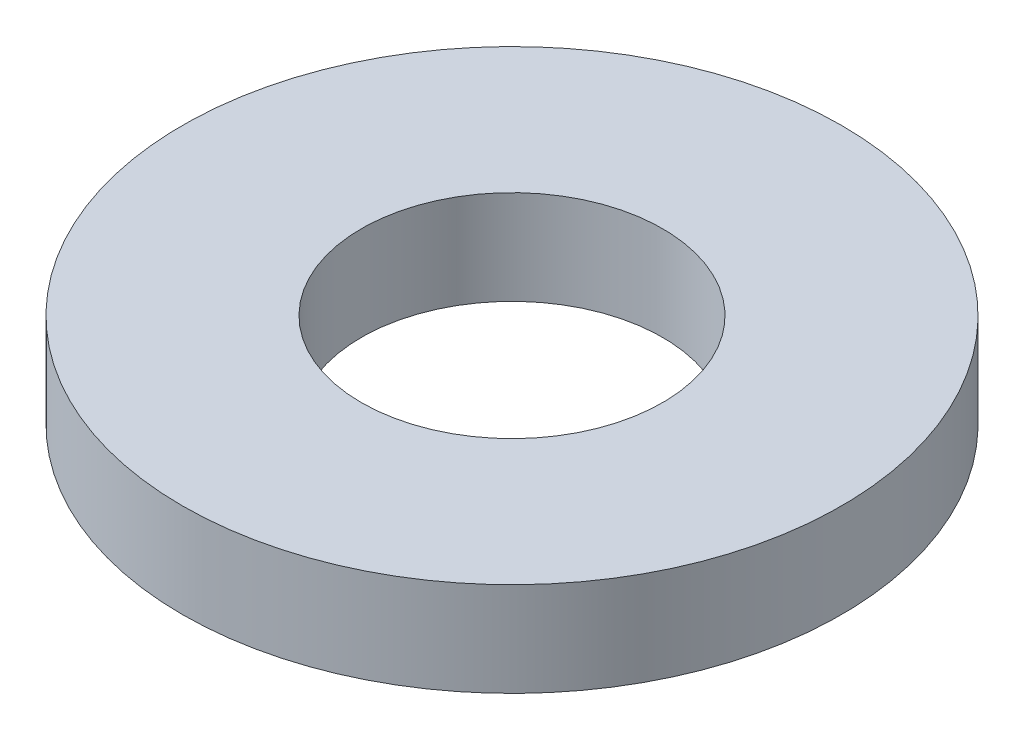
ISO-10303-21;
HEADER;
FILE_DESCRIPTION(('STEP AP214'),'2;1');
FILE_NAME('part.step','',(''),(''),'','','');
FILE_SCHEMA(('AUTOMOTIVE_DESIGN { 1 0 10303 214 1 1 1 1 }'));
ENDSEC;
DATA;
#1=APPLICATION_CONTEXT('core data for automotive mechanical design processes');
#2=APPLICATION_PROTOCOL_DEFINITION('international standard','automotive_design',2000,#1);
#3=PRODUCT_CONTEXT('',#1,'mechanical');
#4=PRODUCT('Part','Part','',(#3));
#5=PRODUCT_RELATED_PRODUCT_CATEGORY('part','',(#4));
#6=PRODUCT_DEFINITION_FORMATION('','',#4);
#7=PRODUCT_DEFINITION_CONTEXT('part definition',#1,'design');
#8=PRODUCT_DEFINITION('design','',#6,#7);
#9=PRODUCT_DEFINITION_SHAPE('','',#8);
#10=(LENGTH_UNIT() NAMED_UNIT(*) SI_UNIT(.MILLI.,.METRE.));
#11=(NAMED_UNIT(*) PLANE_ANGLE_UNIT() SI_UNIT($,.RADIAN.));
#12=(NAMED_UNIT(*) SI_UNIT($,.STERADIAN.) SOLID_ANGLE_UNIT());
#13=UNCERTAINTY_MEASURE_WITH_UNIT(LENGTH_MEASURE(1.E-05),#10,'distance_accuracy_value','');
#14=(GEOMETRIC_REPRESENTATION_CONTEXT(3) GLOBAL_UNCERTAINTY_ASSIGNED_CONTEXT((#13)) GLOBAL_UNIT_ASSIGNED_CONTEXT((#10,
#11,#12)) REPRESENTATION_CONTEXT('',''));
#15=CARTESIAN_POINT('',(0.,0.,0.));
#16=DIRECTION('',(0.,0.,1.));
#17=DIRECTION('',(1.,0.,0.));
#18=AXIS2_PLACEMENT_3D('',#15,#16,#17);
#19=CARTESIAN_POINT('',(0.,1.,0.));
#20=DIRECTION('',(0.,1.,0.));
#21=DIRECTION('',(0.,0.,1.));
#22=AXIS2_PLACEMENT_3D('',#19,#20,#21);
#23=PLANE('',#22);
#24=CARTESIAN_POINT('',(0.,1.,0.));
#25=DIRECTION('',(0.,1.,0.));
#26=DIRECTION('',(0.,0.,1.));
#27=AXIS2_PLACEMENT_3D('',#24,#25,#26);
#28=CIRCLE('',#27,3.5);
#29=CARTESIAN_POINT('',(0.,1.,3.5));
#30=VERTEX_POINT('',#29);
#31=EDGE_CURVE('E10',#30,#30,#28,.T.);
#32=ORIENTED_EDGE('',*,*,#31,.T.);
#33=EDGE_LOOP('',(#32));
#34=FACE_BOUND('',#33,.T.);
#35=CARTESIAN_POINT('',(0.,1.,0.));
#36=DIRECTION('',(0.,1.,0.));
#37=DIRECTION('',(0.,0.,1.));
#38=AXIS2_PLACEMENT_3D('',#35,#36,#37);
#39=CIRCLE('',#38,1.59999999999999);
#40=CARTESIAN_POINT('',(0.,1.,1.59999999999999));
#41=VERTEX_POINT('',#40);
#42=EDGE_CURVE('E43',#41,#41,#39,.T.);
#43=ORIENTED_EDGE('',*,*,#42,.F.);
#44=EDGE_LOOP('',(#43));
#45=FACE_BOUND('',#44,.T.);
#46=ADVANCED_FACE('F32',(#34,#45),#23,.T.);
#47=CARTESIAN_POINT('',(0.,0.,0.));
#48=DIRECTION('',(0.,1.,0.));
#49=DIRECTION('',(0.,0.,1.));
#50=AXIS2_PLACEMENT_3D('',#47,#48,#49);
#51=PLANE('',#50);
#52=CARTESIAN_POINT('',(0.,0.,0.));
#53=DIRECTION('',(0.,1.,0.));
#54=DIRECTION('',(0.,0.,1.));
#55=AXIS2_PLACEMENT_3D('',#52,#53,#54);
#56=CIRCLE('',#55,3.5);
#57=CARTESIAN_POINT('',(0.,0.,3.5));
#58=VERTEX_POINT('',#57);
#59=EDGE_CURVE('E36',#58,#58,#56,.T.);
#60=ORIENTED_EDGE('',*,*,#59,.F.);
#61=EDGE_LOOP('',(#60));
#62=FACE_BOUND('',#61,.T.);
#63=CARTESIAN_POINT('',(0.,0.,0.));
#64=DIRECTION('',(0.,1.,0.));
#65=DIRECTION('',(0.,0.,1.));
#66=AXIS2_PLACEMENT_3D('',#63,#64,#65);
#67=CIRCLE('',#66,1.59999999999999);
#68=CARTESIAN_POINT('',(0.,0.,1.59999999999999));
#69=VERTEX_POINT('',#68);
#70=EDGE_CURVE('E45',#69,#69,#67,.T.);
#71=ORIENTED_EDGE('',*,*,#70,.T.);
#72=EDGE_LOOP('',(#71));
#73=FACE_BOUND('',#72,.T.);
#74=ADVANCED_FACE('F55',(#62,#73),#51,.F.);
#75=CARTESIAN_POINT('',(0.,1.,0.));
#76=DIRECTION('',(0.,-1.,0.));
#77=DIRECTION('',(0.,0.,-1.));
#78=AXIS2_PLACEMENT_3D('',#75,#76,#77);
#79=CYLINDRICAL_SURFACE('',#78,3.5);
#80=ORIENTED_EDGE('',*,*,#31,.F.);
#81=EDGE_LOOP('',(#80));
#82=FACE_BOUND('',#81,.T.);
#83=ORIENTED_EDGE('',*,*,#59,.T.);
#84=EDGE_LOOP('',(#83));
#85=FACE_BOUND('',#84,.T.);
#86=ADVANCED_FACE('F34',(#82,#85),#79,.T.);
#87=CARTESIAN_POINT('',(0.,1.,0.));
#88=DIRECTION('',(0.,-1.,0.));
#89=DIRECTION('',(0.,0.,-1.));
#90=AXIS2_PLACEMENT_3D('',#87,#88,#89);
#91=CYLINDRICAL_SURFACE('',#90,1.59999999999999);
#92=ORIENTED_EDGE('',*,*,#42,.T.);
#93=EDGE_LOOP('',(#92));
#94=FACE_BOUND('',#93,.T.);
#95=ORIENTED_EDGE('',*,*,#70,.F.);
#96=EDGE_LOOP('',(#95));
#97=FACE_BOUND('',#96,.T.);
#98=ADVANCED_FACE('F51',(#94,#97),#91,.F.);
#99=CLOSED_SHELL('',(#46,#74,#86,#98));
#100=MANIFOLD_SOLID_BREP('B2',#99);
#101=ADVANCED_BREP_SHAPE_REPRESENTATION('',(#18,#100),#14);
#102=SHAPE_DEFINITION_REPRESENTATION(#9,#101);
ENDSEC;
END-ISO-10303-21;
